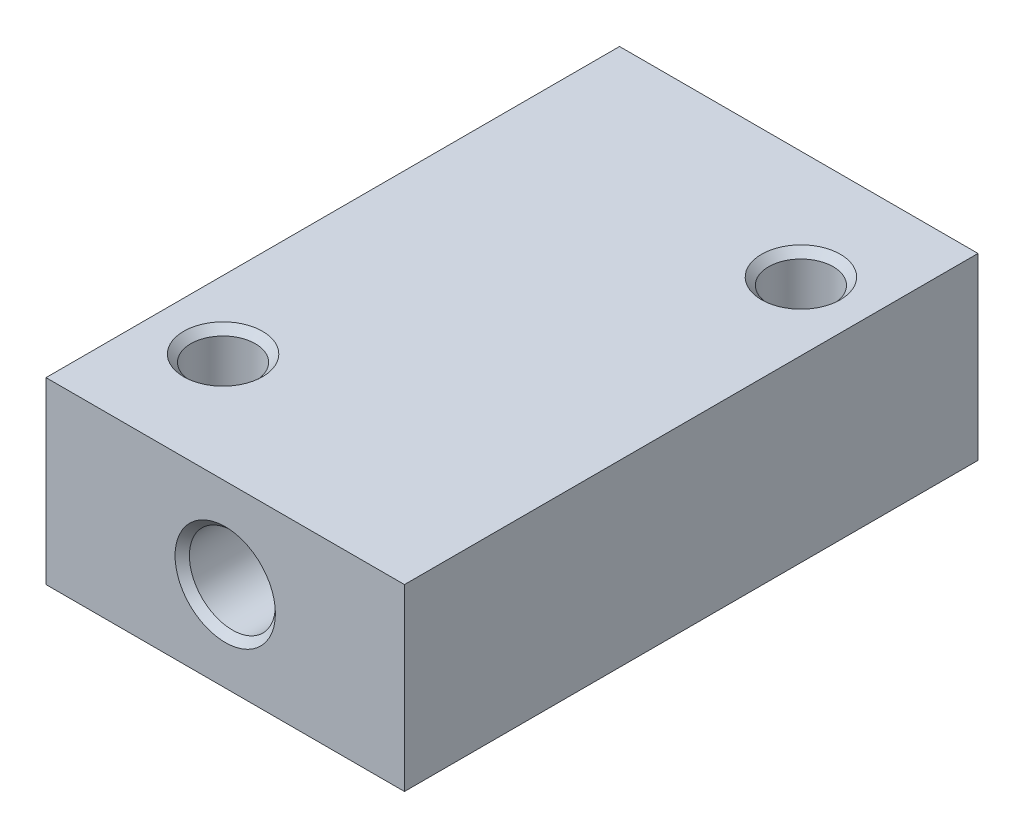
ISO-10303-21;
HEADER;
FILE_DESCRIPTION(('STEP AP214'),'2;1');
FILE_NAME('part.step','',(''),(''),'','','');
FILE_SCHEMA(('AUTOMOTIVE_DESIGN { 1 0 10303 214 1 1 1 1 }'));
ENDSEC;
DATA;
#1=APPLICATION_CONTEXT('core data for automotive mechanical design processes');
#2=APPLICATION_PROTOCOL_DEFINITION('international standard','automotive_design',2000,#1);
#3=PRODUCT_CONTEXT('',#1,'mechanical');
#4=PRODUCT('Part','Part','',(#3));
#5=PRODUCT_RELATED_PRODUCT_CATEGORY('part','',(#4));
#6=PRODUCT_DEFINITION_FORMATION('','',#4);
#7=PRODUCT_DEFINITION_CONTEXT('part definition',#1,'design');
#8=PRODUCT_DEFINITION('design','',#6,#7);
#9=PRODUCT_DEFINITION_SHAPE('','',#8);
#10=(LENGTH_UNIT() NAMED_UNIT(*) SI_UNIT(.MILLI.,.METRE.));
#11=(NAMED_UNIT(*) PLANE_ANGLE_UNIT() SI_UNIT($,.RADIAN.));
#12=(NAMED_UNIT(*) SI_UNIT($,.STERADIAN.) SOLID_ANGLE_UNIT());
#13=UNCERTAINTY_MEASURE_WITH_UNIT(LENGTH_MEASURE(1.E-05),#10,'distance_accuracy_value','');
#14=(GEOMETRIC_REPRESENTATION_CONTEXT(3) GLOBAL_UNCERTAINTY_ASSIGNED_CONTEXT((#13)) GLOBAL_UNIT_ASSIGNED_CONTEXT((#10,
#11,#12)) REPRESENTATION_CONTEXT('',''));
#15=CARTESIAN_POINT('',(0.,0.,0.));
#16=DIRECTION('',(0.,0.,1.));
#17=DIRECTION('',(1.,0.,0.));
#18=AXIS2_PLACEMENT_3D('',#15,#16,#17);
#19=CARTESIAN_POINT('',(-7.21644966006352E-13,12.5000000000001,-40.0000000000029));
#20=DIRECTION('',(0.,0.,1.));
#21=DIRECTION('',(1.,0.,0.));
#22=AXIS2_PLACEMENT_3D('',#19,#20,#21);
#23=CYLINDRICAL_SURFACE('',#22,6.00000000000001);
#24=CARTESIAN_POINT('',(-4.9960036108132E-13,12.5000000000001,38.9999999999873));
#25=DIRECTION('',(0.,0.,1.));
#26=DIRECTION('',(1.,0.,0.));
#27=AXIS2_PLACEMENT_3D('',#24,#25,#26);
#28=CIRCLE('',#27,6.00000000002915);
#29=CARTESIAN_POINT('',(6.00000000002865,12.5000000000001,38.9999999999873));
#30=VERTEX_POINT('',#29);
#31=EDGE_CURVE('E94',#30,#30,#28,.T.);
#32=ORIENTED_EDGE('',*,*,#31,.T.);
#33=EDGE_LOOP('',(#32));
#34=FACE_BOUND('',#33,.T.);
#35=CARTESIAN_POINT('',(-7.21644966006352E-13,12.5000000000001,-39.0000000000027));
#36=DIRECTION('',(0.,0.,-1.));
#37=DIRECTION('',(-1.,0.,0.));
#38=AXIS2_PLACEMENT_3D('',#35,#36,#37);
#39=CIRCLE('',#38,5.9999999999999);
#40=CARTESIAN_POINT('',(-6.00000000000063,12.5000000000001,-39.0000000000027));
#41=VERTEX_POINT('',#40);
#42=EDGE_CURVE('E97',#41,#41,#39,.T.);
#43=ORIENTED_EDGE('',*,*,#42,.T.);
#44=EDGE_LOOP('',(#43));
#45=FACE_BOUND('',#44,.T.);
#46=ADVANCED_FACE('F17',(#34,#45),#23,.F.);
#47=CARTESIAN_POINT('',(15.5000000000003,0.,-24.8000000000015));
#48=DIRECTION('',(0.,-1.,0.));
#49=DIRECTION('',(0.,0.,-1.));
#50=AXIS2_PLACEMENT_3D('',#47,#48,#49);
#51=CONICAL_SURFACE('',#50,5.49999999989587,0.785398163397448);
#52=CARTESIAN_POINT('',(15.5000000000003,-5.6843418860808E-11,-24.8000000000015));
#53=DIRECTION('',(0.,-1.,0.));
#54=DIRECTION('',(0.,0.,-1.));
#55=AXIS2_PLACEMENT_3D('',#52,#53,#54);
#56=CIRCLE('',#55,5.49999999995271);
#57=CARTESIAN_POINT('',(15.5000000000003,-5.6843418860808E-11,-30.2999999999543));
#58=VERTEX_POINT('',#57);
#59=EDGE_CURVE('E20',#58,#58,#56,.T.);
#60=ORIENTED_EDGE('',*,*,#59,.T.);
#61=EDGE_LOOP('',(#60));
#62=FACE_BOUND('',#61,.T.);
#63=CARTESIAN_POINT('',(15.5000000000003,0.99999999999989,-24.8000000000015));
#64=DIRECTION('',(0.,-1.,0.));
#65=DIRECTION('',(0.,0.,-1.));
#66=AXIS2_PLACEMENT_3D('',#63,#64,#65);
#67=CIRCLE('',#66,4.50000000000001);
#68=CARTESIAN_POINT('',(15.5000000000003,0.99999999999989,-29.3000000000015));
#69=VERTEX_POINT('',#68);
#70=EDGE_CURVE('E103',#69,#69,#67,.F.);
#71=ORIENTED_EDGE('',*,*,#70,.T.);
#72=EDGE_LOOP('',(#71));
#73=FACE_BOUND('',#72,.T.);
#74=ADVANCED_FACE('F122',(#62,#73),#51,.F.);
#75=CARTESIAN_POINT('',(-15.5000000000013,1.70530256582424E-10,24.8000000000053));
#76=DIRECTION('',(0.,-1.,0.));
#77=DIRECTION('',(0.,0.,-1.));
#78=AXIS2_PLACEMENT_3D('',#75,#76,#77);
#79=CONICAL_SURFACE('',#78,5.49999999979095,0.78539816342587);
#80=CARTESIAN_POINT('',(-15.5000000000013,3.46979389742092E-11,24.8000000000053));
#81=DIRECTION('',(0.,-1.,0.));
#82=DIRECTION('',(0.,0.,-1.));
#83=AXIS2_PLACEMENT_3D('',#80,#81,#82);
#84=CIRCLE('',#83,5.49999999992679);
#85=CARTESIAN_POINT('',(-15.5000000000013,3.46979389742092E-11,19.3000000000785));
#86=VERTEX_POINT('',#85);
#87=EDGE_CURVE('E93',#86,#86,#84,.T.);
#88=ORIENTED_EDGE('',*,*,#87,.T.);
#89=EDGE_LOOP('',(#88));
#90=FACE_BOUND('',#89,.T.);
#91=CARTESIAN_POINT('',(-15.5000000000013,0.99999999999989,24.8000000000053));
#92=DIRECTION('',(0.,-1.,0.));
#93=DIRECTION('',(0.,0.,-1.));
#94=AXIS2_PLACEMENT_3D('',#91,#92,#93);
#95=CIRCLE('',#94,4.50000000000001);
#96=CARTESIAN_POINT('',(-15.5000000000013,0.99999999999989,20.3000000000053));
#97=VERTEX_POINT('',#96);
#98=EDGE_CURVE('E100',#97,#97,#95,.F.);
#99=ORIENTED_EDGE('',*,*,#98,.T.);
#100=EDGE_LOOP('',(#99));
#101=FACE_BOUND('',#100,.T.);
#102=ADVANCED_FACE('F178',(#90,#101),#79,.F.);
#103=CARTESIAN_POINT('',(15.5000000000003,25.,-24.8000000000015));
#104=DIRECTION('',(0.,-1.,0.));
#105=DIRECTION('',(0.,0.,-1.));
#106=AXIS2_PLACEMENT_3D('',#103,#104,#105);
#107=CYLINDRICAL_SURFACE('',#106,4.50000000000001);
#108=CARTESIAN_POINT('',(15.5000000000003,24.0000000000009,-24.8000000000015));
#109=DIRECTION('',(0.,1.,0.));
#110=DIRECTION('',(0.,0.,1.));
#111=AXIS2_PLACEMENT_3D('',#108,#109,#110);
#112=CIRCLE('',#111,4.49999999998135);
#113=CARTESIAN_POINT('',(15.5000000000003,24.0000000000009,-20.3000000000202));
#114=VERTEX_POINT('',#113);
#115=EDGE_CURVE('E90',#114,#114,#112,.T.);
#116=ORIENTED_EDGE('',*,*,#115,.T.);
#117=EDGE_LOOP('',(#116));
#118=FACE_BOUND('',#117,.T.);
#119=ORIENTED_EDGE('',*,*,#70,.F.);
#120=EDGE_LOOP('',(#119));
#121=FACE_BOUND('',#120,.T.);
#122=ADVANCED_FACE('F174',(#118,#121),#107,.F.);
#123=CARTESIAN_POINT('',(-15.5000000000013,25.,24.8000000000053));
#124=DIRECTION('',(0.,-1.,0.));
#125=DIRECTION('',(0.,0.,-1.));
#126=AXIS2_PLACEMENT_3D('',#123,#124,#125);
#127=CYLINDRICAL_SURFACE('',#126,4.50000000000001);
#128=CARTESIAN_POINT('',(-15.5000000000013,24.0000000000009,24.8000000000053));
#129=DIRECTION('',(0.,1.,0.));
#130=DIRECTION('',(0.,0.,1.));
#131=AXIS2_PLACEMENT_3D('',#128,#129,#130);
#132=CIRCLE('',#131,4.49999999997258);
#133=CARTESIAN_POINT('',(-15.5000000000013,24.0000000000009,29.2999999999779));
#134=VERTEX_POINT('',#133);
#135=EDGE_CURVE('E70',#134,#134,#132,.T.);
#136=ORIENTED_EDGE('',*,*,#135,.T.);
#137=EDGE_LOOP('',(#136));
#138=FACE_BOUND('',#137,.T.);
#139=ORIENTED_EDGE('',*,*,#98,.F.);
#140=EDGE_LOOP('',(#139));
#141=FACE_BOUND('',#140,.T.);
#142=ADVANCED_FACE('F171',(#138,#141),#127,.F.);
#143=CARTESIAN_POINT('',(-7.21644966006352E-13,12.5000000000001,-40.0000000000029));
#144=DIRECTION('',(0.,0.,-1.));
#145=DIRECTION('',(-1.,0.,0.));
#146=AXIS2_PLACEMENT_3D('',#143,#144,#145);
#147=CONICAL_SURFACE('',#146,7.00000000000003,0.78539816339745);
#148=CARTESIAN_POINT('',(-7.21644966006352E-13,12.5000000000001,-40.0000000000029));
#149=DIRECTION('',(0.,0.,-1.));
#150=DIRECTION('',(-1.,0.,0.));
#151=AXIS2_PLACEMENT_3D('',#148,#149,#150);
#152=CIRCLE('',#151,7.00000000000003);
#153=CARTESIAN_POINT('',(-7.00000000000075,12.5000000000001,-40.0000000000029));
#154=VERTEX_POINT('',#153);
#155=EDGE_CURVE('E69',#154,#154,#152,.T.);
#156=ORIENTED_EDGE('',*,*,#155,.T.);
#157=EDGE_LOOP('',(#156));
#158=FACE_BOUND('',#157,.T.);
#159=ORIENTED_EDGE('',*,*,#42,.F.);
#160=EDGE_LOOP('',(#159));
#161=FACE_BOUND('',#160,.T.);
#162=ADVANCED_FACE('F137',(#158,#161),#147,.F.);
#163=CARTESIAN_POINT('',(-4.9960036108132E-13,12.5000000000001,39.9999999999068));
#164=DIRECTION('',(0.,0.,1.));
#165=DIRECTION('',(1.,0.,0.));
#166=AXIS2_PLACEMENT_3D('',#163,#164,#165);
#167=CONICAL_SURFACE('',#166,6.99999999994866,0.78539816342587);
#168=CARTESIAN_POINT('',(-4.9960036108132E-13,12.5000000000001,39.9999999999631));
#169=DIRECTION('',(0.,0.,1.));
#170=DIRECTION('',(1.,0.,0.));
#171=AXIS2_PLACEMENT_3D('',#168,#169,#170);
#172=CIRCLE('',#171,7.000000000005);
#173=CARTESIAN_POINT('',(7.0000000000045,12.5000000000001,39.9999999999631));
#174=VERTEX_POINT('',#173);
#175=EDGE_CURVE('E114',#174,#174,#172,.T.);
#176=ORIENTED_EDGE('',*,*,#175,.T.);
#177=EDGE_LOOP('',(#176));
#178=FACE_BOUND('',#177,.T.);
#179=ORIENTED_EDGE('',*,*,#31,.F.);
#180=EDGE_LOOP('',(#179));
#181=FACE_BOUND('',#180,.T.);
#182=ADVANCED_FACE('F127',(#178,#181),#167,.F.);
#183=CARTESIAN_POINT('',(0.,0.,0.));
#184=DIRECTION('',(0.,1.,0.));
#185=DIRECTION('',(0.,0.,1.));
#186=AXIS2_PLACEMENT_3D('',#183,#184,#185);
#187=PLANE('',#186);
#188=DIRECTION('',(-1.,0.,0.));
#189=VECTOR('',#188,1.);
#190=CARTESIAN_POINT('',(-25.0000000000037,0.,40.0000000000068));
#191=LINE('',#190,#189);
#192=CARTESIAN_POINT('',(25.0000000000014,0.,40.0000000000063));
#193=VERTEX_POINT('',#192);
#194=CARTESIAN_POINT('',(-25.000000000002,0.,40.0000000000068));
#195=VERTEX_POINT('',#194);
#196=EDGE_CURVE('E113',#193,#195,#191,.T.);
#197=ORIENTED_EDGE('',*,*,#196,.T.);
#198=DIRECTION('',(0.,0.,-1.));
#199=VECTOR('',#198,1.);
#200=CARTESIAN_POINT('',(-25.0000000000014,0.,-40.0000000000026));
#201=LINE('',#200,#199);
#202=CARTESIAN_POINT('',(-25.0000000000014,0.,-40.0000000000022));
#203=VERTEX_POINT('',#202);
#204=EDGE_CURVE('E74',#195,#203,#201,.T.);
#205=ORIENTED_EDGE('',*,*,#204,.T.);
#206=DIRECTION('',(1.,0.,0.));
#207=VECTOR('',#206,1.);
#208=CARTESIAN_POINT('',(-25.0000000000014,0.,-40.0000000000026));
#209=LINE('',#208,#207);
#210=CARTESIAN_POINT('',(25.0000000000009,0.,-40.0000000000012));
#211=VERTEX_POINT('',#210);
#212=EDGE_CURVE('E55',#203,#211,#209,.T.);
#213=ORIENTED_EDGE('',*,*,#212,.T.);
#214=DIRECTION('',(0.,0.,1.));
#215=VECTOR('',#214,1.);
#216=CARTESIAN_POINT('',(25.0000000000004,0.,-40.0000000000008));
#217=LINE('',#216,#215);
#218=EDGE_CURVE('E60',#211,#193,#217,.T.);
#219=ORIENTED_EDGE('',*,*,#218,.T.);
#220=EDGE_LOOP('',(#197,#205,#213,#219));
#221=FACE_BOUND('',#220,.T.);
#222=ORIENTED_EDGE('',*,*,#87,.F.);
#223=EDGE_LOOP('',(#222));
#224=FACE_BOUND('',#223,.T.);
#225=ORIENTED_EDGE('',*,*,#59,.F.);
#226=EDGE_LOOP('',(#225));
#227=FACE_BOUND('',#226,.T.);
#228=ADVANCED_FACE('F72',(#221,#224,#227),#187,.F.);
#229=CARTESIAN_POINT('',(15.5000000000003,24.9999999999773,-24.8000000000015));
#230=DIRECTION('',(0.,1.,0.));
#231=DIRECTION('',(0.,0.,1.));
#232=AXIS2_PLACEMENT_3D('',#229,#230,#231);
#233=CONICAL_SURFACE('',#232,5.4999999999577,0.785398163397448);
#234=ORIENTED_EDGE('',*,*,#115,.F.);
#235=EDGE_LOOP('',(#234));
#236=FACE_BOUND('',#235,.T.);
#237=CARTESIAN_POINT('',(15.5000000000003,24.9999999999773,-24.8000000000015));
#238=DIRECTION('',(0.,1.,0.));
#239=DIRECTION('',(0.,0.,1.));
#240=AXIS2_PLACEMENT_3D('',#237,#238,#239);
#241=CIRCLE('',#240,5.4999999999577);
#242=CARTESIAN_POINT('',(15.5000000000003,24.9999999999773,-19.3000000000438));
#243=VERTEX_POINT('',#242);
#244=EDGE_CURVE('E110',#243,#243,#241,.F.);
#245=ORIENTED_EDGE('',*,*,#244,.F.);
#246=EDGE_LOOP('',(#245));
#247=FACE_BOUND('',#246,.T.);
#248=ADVANCED_FACE('F126',(#236,#247),#233,.F.);
#249=CARTESIAN_POINT('',(-15.5000000000013,25.0000000000909,24.8000000000053));
#250=DIRECTION('',(0.,1.,0.));
#251=DIRECTION('',(0.,0.,1.));
#252=AXIS2_PLACEMENT_3D('',#249,#250,#251);
#253=CONICAL_SURFACE('',#252,5.50000000006262,0.785398163397448);
#254=ORIENTED_EDGE('',*,*,#135,.F.);
#255=EDGE_LOOP('',(#254));
#256=FACE_BOUND('',#255,.T.);
#257=CARTESIAN_POINT('',(-15.5000000000013,25.0000000000341,24.8000000000053));
#258=DIRECTION('',(0.,1.,0.));
#259=DIRECTION('',(0.,0.,1.));
#260=AXIS2_PLACEMENT_3D('',#257,#258,#259);
#261=CIRCLE('',#260,5.50000000000577);
#262=CARTESIAN_POINT('',(-15.5000000000013,25.0000000000341,30.3000000000111));
#263=VERTEX_POINT('',#262);
#264=EDGE_CURVE('E106',#263,#263,#261,.F.);
#265=ORIENTED_EDGE('',*,*,#264,.F.);
#266=EDGE_LOOP('',(#265));
#267=FACE_BOUND('',#266,.T.);
#268=ADVANCED_FACE('F134',(#256,#267),#253,.F.);
#269=CARTESIAN_POINT('',(25.0000000000004,25.,-40.0000000000008));
#270=DIRECTION('',(-1.,0.,0.));
#271=DIRECTION('',(0.,0.,1.));
#272=AXIS2_PLACEMENT_3D('',#269,#270,#271);
#273=PLANE('',#272);
#274=DIRECTION('',(0.,1.,0.));
#275=VECTOR('',#274,1.);
#276=CARTESIAN_POINT('',(25.0000000000004,25.,-40.0000000000026));
#277=LINE('',#276,#275);
#278=CARTESIAN_POINT('',(25.0000000000009,25.,-40.0000000000012));
#279=VERTEX_POINT('',#278);
#280=EDGE_CURVE('E62',#211,#279,#277,.T.);
#281=ORIENTED_EDGE('',*,*,#280,.T.);
#282=DIRECTION('',(0.,0.,1.));
#283=VECTOR('',#282,1.);
#284=CARTESIAN_POINT('',(25.0000000000024,25.,0.));
#285=LINE('',#284,#283);
#286=CARTESIAN_POINT('',(25.0000000000014,25.,40.0000000000063));
#287=VERTEX_POINT('',#286);
#288=EDGE_CURVE('E109',#287,#279,#285,.F.);
#289=ORIENTED_EDGE('',*,*,#288,.F.);
#290=DIRECTION('',(0.,1.,0.));
#291=VECTOR('',#290,1.);
#292=CARTESIAN_POINT('',(25.0000000000024,25.,40.0000000000068));
#293=LINE('',#292,#291);
#294=EDGE_CURVE('E65',#287,#193,#293,.F.);
#295=ORIENTED_EDGE('',*,*,#294,.T.);
#296=ORIENTED_EDGE('',*,*,#218,.F.);
#297=EDGE_LOOP('',(#281,#289,#295,#296));
#298=FACE_BOUND('',#297,.T.);
#299=ADVANCED_FACE('F61',(#298),#273,.F.);
#300=CARTESIAN_POINT('',(-25.0000000000014,25.,-40.0000000000026));
#301=DIRECTION('',(0.,0.,1.));
#302=DIRECTION('',(1.,0.,0.));
#303=AXIS2_PLACEMENT_3D('',#300,#301,#302);
#304=PLANE('',#303);
#305=DIRECTION('',(0.,1.,0.));
#306=VECTOR('',#305,1.);
#307=CARTESIAN_POINT('',(-25.0000000000014,25.,-40.0000000000026));
#308=LINE('',#307,#306);
#309=CARTESIAN_POINT('',(-25.0000000000014,25.,-40.0000000000022));
#310=VERTEX_POINT('',#309);
#311=EDGE_CURVE('E76',#203,#310,#308,.T.);
#312=ORIENTED_EDGE('',*,*,#311,.T.);
#313=DIRECTION('',(1.,0.,0.));
#314=VECTOR('',#313,1.);
#315=CARTESIAN_POINT('',(0.,25.,-40.0000000000008));
#316=LINE('',#315,#314);
#317=EDGE_CURVE('E81',#279,#310,#316,.F.);
#318=ORIENTED_EDGE('',*,*,#317,.F.);
#319=ORIENTED_EDGE('',*,*,#280,.F.);
#320=ORIENTED_EDGE('',*,*,#212,.F.);
#321=EDGE_LOOP('',(#312,#318,#319,#320));
#322=FACE_BOUND('',#321,.T.);
#323=ORIENTED_EDGE('',*,*,#155,.F.);
#324=EDGE_LOOP('',(#323));
#325=FACE_BOUND('',#324,.T.);
#326=ADVANCED_FACE('F78',(#322,#325),#304,.F.);
#327=CARTESIAN_POINT('',(-25.0000000000014,25.,-40.0000000000026));
#328=DIRECTION('',(1.,0.,0.));
#329=DIRECTION('',(0.,0.,-1.));
#330=AXIS2_PLACEMENT_3D('',#327,#328,#329);
#331=PLANE('',#330);
#332=DIRECTION('',(0.,1.,0.));
#333=VECTOR('',#332,1.);
#334=CARTESIAN_POINT('',(-25.0000000000037,25.,40.0000000000068));
#335=LINE('',#334,#333);
#336=CARTESIAN_POINT('',(-25.000000000002,25.,40.0000000000068));
#337=VERTEX_POINT('',#336);
#338=EDGE_CURVE('E35',#195,#337,#335,.T.);
#339=ORIENTED_EDGE('',*,*,#338,.T.);
#340=DIRECTION('',(0.,0.,1.));
#341=VECTOR('',#340,1.);
#342=CARTESIAN_POINT('',(-25.0000000000014,25.,0.));
#343=LINE('',#342,#341);
#344=EDGE_CURVE('E26',#310,#337,#343,.T.);
#345=ORIENTED_EDGE('',*,*,#344,.F.);
#346=ORIENTED_EDGE('',*,*,#311,.F.);
#347=ORIENTED_EDGE('',*,*,#204,.F.);
#348=EDGE_LOOP('',(#339,#345,#346,#347));
#349=FACE_BOUND('',#348,.T.);
#350=ADVANCED_FACE('F148',(#349),#331,.F.);
#351=CARTESIAN_POINT('',(-25.0000000000037,25.,40.0000000000068));
#352=DIRECTION('',(0.,0.,-1.));
#353=DIRECTION('',(-1.,0.,0.));
#354=AXIS2_PLACEMENT_3D('',#351,#352,#353);
#355=PLANE('',#354);
#356=ORIENTED_EDGE('',*,*,#294,.F.);
#357=DIRECTION('',(1.,0.,0.));
#358=VECTOR('',#357,1.);
#359=CARTESIAN_POINT('',(0.,25.,40.0000000000068));
#360=LINE('',#359,#358);
#361=EDGE_CURVE('E11',#337,#287,#360,.T.);
#362=ORIENTED_EDGE('',*,*,#361,.F.);
#363=ORIENTED_EDGE('',*,*,#338,.F.);
#364=ORIENTED_EDGE('',*,*,#196,.F.);
#365=EDGE_LOOP('',(#356,#362,#363,#364));
#366=FACE_BOUND('',#365,.T.);
#367=ORIENTED_EDGE('',*,*,#175,.F.);
#368=EDGE_LOOP('',(#367));
#369=FACE_BOUND('',#368,.T.);
#370=ADVANCED_FACE('F142',(#366,#369),#355,.F.);
#371=CARTESIAN_POINT('',(0.,25.,0.));
#372=DIRECTION('',(0.,1.,0.));
#373=DIRECTION('',(0.,0.,1.));
#374=AXIS2_PLACEMENT_3D('',#371,#372,#373);
#375=PLANE('',#374);
#376=ORIENTED_EDGE('',*,*,#344,.T.);
#377=ORIENTED_EDGE('',*,*,#361,.T.);
#378=ORIENTED_EDGE('',*,*,#288,.T.);
#379=ORIENTED_EDGE('',*,*,#317,.T.);
#380=EDGE_LOOP('',(#376,#377,#378,#379));
#381=FACE_BOUND('',#380,.T.);
#382=ORIENTED_EDGE('',*,*,#264,.T.);
#383=EDGE_LOOP('',(#382));
#384=FACE_BOUND('',#383,.T.);
#385=ORIENTED_EDGE('',*,*,#244,.T.);
#386=EDGE_LOOP('',(#385));
#387=FACE_BOUND('',#386,.T.);
#388=ADVANCED_FACE('F140',(#381,#384,#387),#375,.T.);
#389=CLOSED_SHELL('',(#46,#74,#102,#122,#142,#162,#182,#228,#248,#268,#299,#326,#350,#370,#388));
#390=MANIFOLD_SOLID_BREP('B1',#389);
#391=ADVANCED_BREP_SHAPE_REPRESENTATION('',(#18,#390),#14);
#392=SHAPE_DEFINITION_REPRESENTATION(#9,#391);
ENDSEC;
END-ISO-10303-21;
